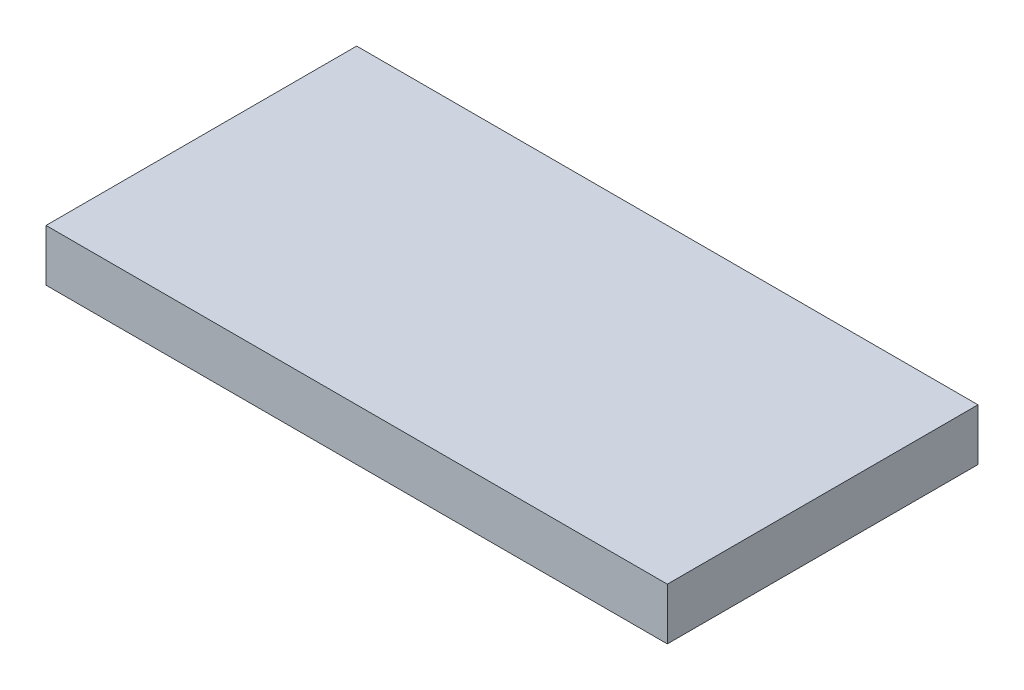
ISO-10303-21;
HEADER;
FILE_DESCRIPTION(('STEP AP214'),'2;1');
FILE_NAME('part.step','',(''),(''),'','','');
FILE_SCHEMA(('AUTOMOTIVE_DESIGN { 1 0 10303 214 1 1 1 1 }'));
ENDSEC;
DATA;
#1=APPLICATION_CONTEXT('core data for automotive mechanical design processes');
#2=APPLICATION_PROTOCOL_DEFINITION('international standard','automotive_design',2000,#1);
#3=PRODUCT_CONTEXT('',#1,'mechanical');
#4=PRODUCT('Part','Part','',(#3));
#5=PRODUCT_RELATED_PRODUCT_CATEGORY('part','',(#4));
#6=PRODUCT_DEFINITION_FORMATION('','',#4);
#7=PRODUCT_DEFINITION_CONTEXT('part definition',#1,'design');
#8=PRODUCT_DEFINITION('design','',#6,#7);
#9=PRODUCT_DEFINITION_SHAPE('','',#8);
#10=(LENGTH_UNIT() NAMED_UNIT(*) SI_UNIT(.MILLI.,.METRE.));
#11=(NAMED_UNIT(*) PLANE_ANGLE_UNIT() SI_UNIT($,.RADIAN.));
#12=(NAMED_UNIT(*) SI_UNIT($,.STERADIAN.) SOLID_ANGLE_UNIT());
#13=UNCERTAINTY_MEASURE_WITH_UNIT(LENGTH_MEASURE(1.E-05),#10,'distance_accuracy_value','');
#14=(GEOMETRIC_REPRESENTATION_CONTEXT(3) GLOBAL_UNCERTAINTY_ASSIGNED_CONTEXT((#13)) GLOBAL_UNIT_ASSIGNED_CONTEXT((#10,
#11,#12)) REPRESENTATION_CONTEXT('',''));
#15=CARTESIAN_POINT('',(0.,0.,0.));
#16=DIRECTION('',(0.,0.,1.));
#17=DIRECTION('',(1.,0.,0.));
#18=AXIS2_PLACEMENT_3D('',#15,#16,#17);
#19=CARTESIAN_POINT('',(0.,5.,0.));
#20=DIRECTION('',(1.,0.,0.));
#21=DIRECTION('',(0.,0.,-1.));
#22=AXIS2_PLACEMENT_3D('',#19,#20,#21);
#23=PLANE('',#22);
#24=DIRECTION('',(0.,0.,1.));
#25=VECTOR('',#24,1.);
#26=CARTESIAN_POINT('',(0.,0.,0.));
#27=LINE('',#26,#25);
#28=CARTESIAN_POINT('',(0.,0.,-30.));
#29=VERTEX_POINT('',#28);
#30=CARTESIAN_POINT('',(0.,0.,0.));
#31=VERTEX_POINT('',#30);
#32=EDGE_CURVE('E96',#29,#31,#27,.T.);
#33=ORIENTED_EDGE('',*,*,#32,.T.);
#34=DIRECTION('',(0.,-1.,0.));
#35=VECTOR('',#34,1.);
#36=CARTESIAN_POINT('',(0.,5.,0.));
#37=LINE('',#36,#35);
#38=CARTESIAN_POINT('',(0.,5.,0.));
#39=VERTEX_POINT('',#38);
#40=EDGE_CURVE('E11',#39,#31,#37,.T.);
#41=ORIENTED_EDGE('',*,*,#40,.F.);
#42=DIRECTION('',(0.,0.,1.));
#43=VECTOR('',#42,1.);
#44=CARTESIAN_POINT('',(0.,5.,0.));
#45=LINE('',#44,#43);
#46=CARTESIAN_POINT('',(0.,5.,-30.));
#47=VERTEX_POINT('',#46);
#48=EDGE_CURVE('E84',#47,#39,#45,.T.);
#49=ORIENTED_EDGE('',*,*,#48,.F.);
#50=DIRECTION('',(0.,-1.,0.));
#51=VECTOR('',#50,1.);
#52=CARTESIAN_POINT('',(0.,5.,-30.));
#53=LINE('',#52,#51);
#54=EDGE_CURVE('E92',#47,#29,#53,.T.);
#55=ORIENTED_EDGE('',*,*,#54,.T.);
#56=EDGE_LOOP('',(#33,#41,#49,#55));
#57=FACE_BOUND('',#56,.T.);
#58=ADVANCED_FACE('F33',(#57),#23,.F.);
#59=CARTESIAN_POINT('',(0.,5.,0.));
#60=DIRECTION('',(0.,0.,-1.));
#61=DIRECTION('',(-1.,0.,0.));
#62=AXIS2_PLACEMENT_3D('',#59,#60,#61);
#63=PLANE('',#62);
#64=DIRECTION('',(1.,0.,0.));
#65=VECTOR('',#64,1.);
#66=CARTESIAN_POINT('',(0.,0.,0.));
#67=LINE('',#66,#65);
#68=CARTESIAN_POINT('',(60.,0.,0.));
#69=VERTEX_POINT('',#68);
#70=EDGE_CURVE('E88',#31,#69,#67,.T.);
#71=ORIENTED_EDGE('',*,*,#70,.T.);
#72=DIRECTION('',(0.,-1.,0.));
#73=VECTOR('',#72,1.);
#74=CARTESIAN_POINT('',(60.,5.,0.));
#75=LINE('',#74,#73);
#76=CARTESIAN_POINT('',(60.,5.,0.));
#77=VERTEX_POINT('',#76);
#78=EDGE_CURVE('E41',#77,#69,#75,.T.);
#79=ORIENTED_EDGE('',*,*,#78,.F.);
#80=DIRECTION('',(1.,0.,0.));
#81=VECTOR('',#80,1.);
#82=CARTESIAN_POINT('',(0.,5.,0.));
#83=LINE('',#82,#81);
#84=EDGE_CURVE('E79',#39,#77,#83,.T.);
#85=ORIENTED_EDGE('',*,*,#84,.F.);
#86=ORIENTED_EDGE('',*,*,#40,.T.);
#87=EDGE_LOOP('',(#71,#79,#85,#86));
#88=FACE_BOUND('',#87,.T.);
#89=ADVANCED_FACE('F87',(#88),#63,.F.);
#90=CARTESIAN_POINT('',(60.,5.,0.));
#91=DIRECTION('',(-1.,0.,0.));
#92=DIRECTION('',(0.,0.,1.));
#93=AXIS2_PLACEMENT_3D('',#90,#91,#92);
#94=PLANE('',#93);
#95=DIRECTION('',(0.,0.,-1.));
#96=VECTOR('',#95,1.);
#97=CARTESIAN_POINT('',(60.,0.,0.));
#98=LINE('',#97,#96);
#99=CARTESIAN_POINT('',(60.,0.,-30.));
#100=VERTEX_POINT('',#99);
#101=EDGE_CURVE('E66',#69,#100,#98,.T.);
#102=ORIENTED_EDGE('',*,*,#101,.T.);
#103=DIRECTION('',(0.,-1.,0.));
#104=VECTOR('',#103,1.);
#105=CARTESIAN_POINT('',(60.,5.,-30.));
#106=LINE('',#105,#104);
#107=CARTESIAN_POINT('',(60.,5.,-30.));
#108=VERTEX_POINT('',#107);
#109=EDGE_CURVE('E89',#108,#100,#106,.T.);
#110=ORIENTED_EDGE('',*,*,#109,.F.);
#111=DIRECTION('',(0.,0.,-1.));
#112=VECTOR('',#111,1.);
#113=CARTESIAN_POINT('',(60.,5.,0.));
#114=LINE('',#113,#112);
#115=EDGE_CURVE('E82',#77,#108,#114,.T.);
#116=ORIENTED_EDGE('',*,*,#115,.F.);
#117=ORIENTED_EDGE('',*,*,#78,.T.);
#118=EDGE_LOOP('',(#102,#110,#116,#117));
#119=FACE_BOUND('',#118,.T.);
#120=ADVANCED_FACE('F90',(#119),#94,.F.);
#121=CARTESIAN_POINT('',(0.,5.,-30.));
#122=DIRECTION('',(0.,0.,1.));
#123=DIRECTION('',(1.,0.,0.));
#124=AXIS2_PLACEMENT_3D('',#121,#122,#123);
#125=PLANE('',#124);
#126=DIRECTION('',(-1.,0.,0.));
#127=VECTOR('',#126,1.);
#128=CARTESIAN_POINT('',(0.,0.,-30.));
#129=LINE('',#128,#127);
#130=EDGE_CURVE('E72',#100,#29,#129,.T.);
#131=ORIENTED_EDGE('',*,*,#130,.T.);
#132=ORIENTED_EDGE('',*,*,#54,.F.);
#133=DIRECTION('',(-1.,0.,0.));
#134=VECTOR('',#133,1.);
#135=CARTESIAN_POINT('',(0.,5.,-30.));
#136=LINE('',#135,#134);
#137=EDGE_CURVE('E49',#108,#47,#136,.T.);
#138=ORIENTED_EDGE('',*,*,#137,.F.);
#139=ORIENTED_EDGE('',*,*,#109,.T.);
#140=EDGE_LOOP('',(#131,#132,#138,#139));
#141=FACE_BOUND('',#140,.T.);
#142=ADVANCED_FACE('F103',(#141),#125,.F.);
#143=CARTESIAN_POINT('',(0.,5.,0.));
#144=DIRECTION('',(0.,-1.,0.));
#145=DIRECTION('',(0.,0.,-1.));
#146=AXIS2_PLACEMENT_3D('',#143,#144,#145);
#147=PLANE('',#146);
#148=ORIENTED_EDGE('',*,*,#48,.T.);
#149=ORIENTED_EDGE('',*,*,#84,.T.);
#150=ORIENTED_EDGE('',*,*,#115,.T.);
#151=ORIENTED_EDGE('',*,*,#137,.T.);
#152=EDGE_LOOP('',(#148,#149,#150,#151));
#153=FACE_BOUND('',#152,.T.);
#154=ADVANCED_FACE('F80',(#153),#147,.F.);
#155=CARTESIAN_POINT('',(0.,0.,0.));
#156=DIRECTION('',(0.,-1.,0.));
#157=DIRECTION('',(0.,0.,-1.));
#158=AXIS2_PLACEMENT_3D('',#155,#156,#157);
#159=PLANE('',#158);
#160=ORIENTED_EDGE('',*,*,#32,.F.);
#161=ORIENTED_EDGE('',*,*,#130,.F.);
#162=ORIENTED_EDGE('',*,*,#101,.F.);
#163=ORIENTED_EDGE('',*,*,#70,.F.);
#164=EDGE_LOOP('',(#160,#161,#162,#163));
#165=FACE_BOUND('',#164,.T.);
#166=ADVANCED_FACE('F106',(#165),#159,.T.);
#167=CLOSED_SHELL('',(#58,#89,#120,#142,#154,#166));
#168=MANIFOLD_SOLID_BREP('B2',#167);
#169=ADVANCED_BREP_SHAPE_REPRESENTATION('',(#18,#168),#14);
#170=SHAPE_DEFINITION_REPRESENTATION(#9,#169);
ENDSEC;
END-ISO-10303-21;
